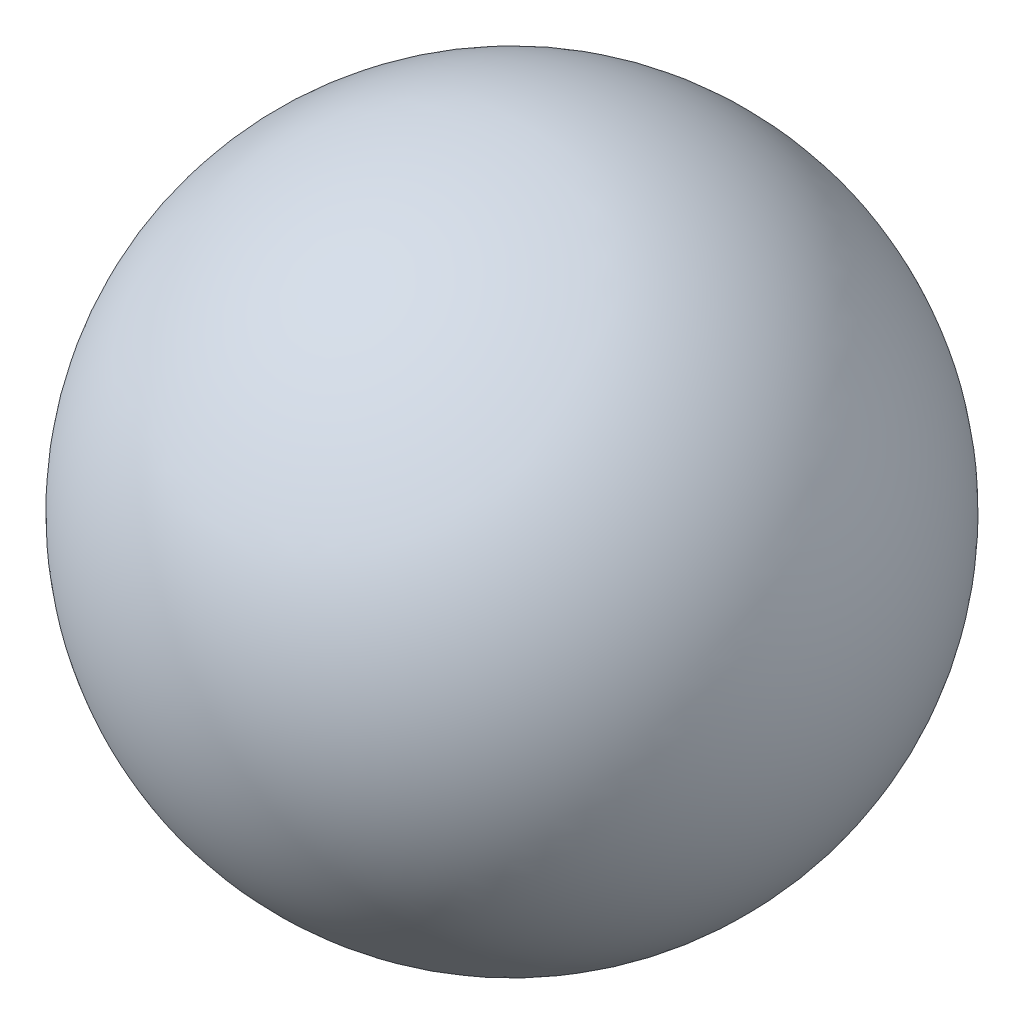
ISO-10303-21;
HEADER;
FILE_DESCRIPTION(('STEP AP214'),'2;1');
FILE_NAME('part.step','',(''),(''),'','','');
FILE_SCHEMA(('AUTOMOTIVE_DESIGN { 1 0 10303 214 1 1 1 1 }'));
ENDSEC;
DATA;
#1=APPLICATION_CONTEXT('core data for automotive mechanical design processes');
#2=APPLICATION_PROTOCOL_DEFINITION('international standard','automotive_design',2000,#1);
#3=PRODUCT_CONTEXT('',#1,'mechanical');
#4=PRODUCT('Part','Part','',(#3));
#5=PRODUCT_RELATED_PRODUCT_CATEGORY('part','',(#4));
#6=PRODUCT_DEFINITION_FORMATION('','',#4);
#7=PRODUCT_DEFINITION_CONTEXT('part definition',#1,'design');
#8=PRODUCT_DEFINITION('design','',#6,#7);
#9=PRODUCT_DEFINITION_SHAPE('','',#8);
#10=(LENGTH_UNIT() NAMED_UNIT(*) SI_UNIT(.MILLI.,.METRE.));
#11=(NAMED_UNIT(*) PLANE_ANGLE_UNIT() SI_UNIT($,.RADIAN.));
#12=(NAMED_UNIT(*) SI_UNIT($,.STERADIAN.) SOLID_ANGLE_UNIT());
#13=UNCERTAINTY_MEASURE_WITH_UNIT(LENGTH_MEASURE(1.E-05),#10,'distance_accuracy_value','');
#14=(GEOMETRIC_REPRESENTATION_CONTEXT(3) GLOBAL_UNCERTAINTY_ASSIGNED_CONTEXT((#13)) GLOBAL_UNIT_ASSIGNED_CONTEXT((#10,
#11,#12)) REPRESENTATION_CONTEXT('',''));
#15=CARTESIAN_POINT('',(0.,0.,0.));
#16=DIRECTION('',(0.,0.,1.));
#17=DIRECTION('',(1.,0.,0.));
#18=AXIS2_PLACEMENT_3D('',#15,#16,#17);
#19=CARTESIAN_POINT('',(0.,0.,0.));
#20=DIRECTION('',(0.,0.,-1.));
#21=DIRECTION('',(1.,0.,0.));
#22=AXIS2_PLACEMENT_3D('',#19,#20,#21);
#23=SPHERICAL_SURFACE('',#22,164.7);
#24=CARTESIAN_POINT('',(0.,0.,-164.7));
#25=VERTEX_POINT('',#24);
#26=VERTEX_LOOP('',#25);
#27=FACE_BOUND('',#26,.T.);
#28=ADVANCED_FACE('F31',(#27),#23,.T.);
#29=CLOSED_SHELL('',(#28));
#30=MANIFOLD_SOLID_BREP('B2',#29);
#31=ADVANCED_BREP_SHAPE_REPRESENTATION('',(#18,#30),#14);
#32=SHAPE_DEFINITION_REPRESENTATION(#9,#31);
ENDSEC;
END-ISO-10303-21;
